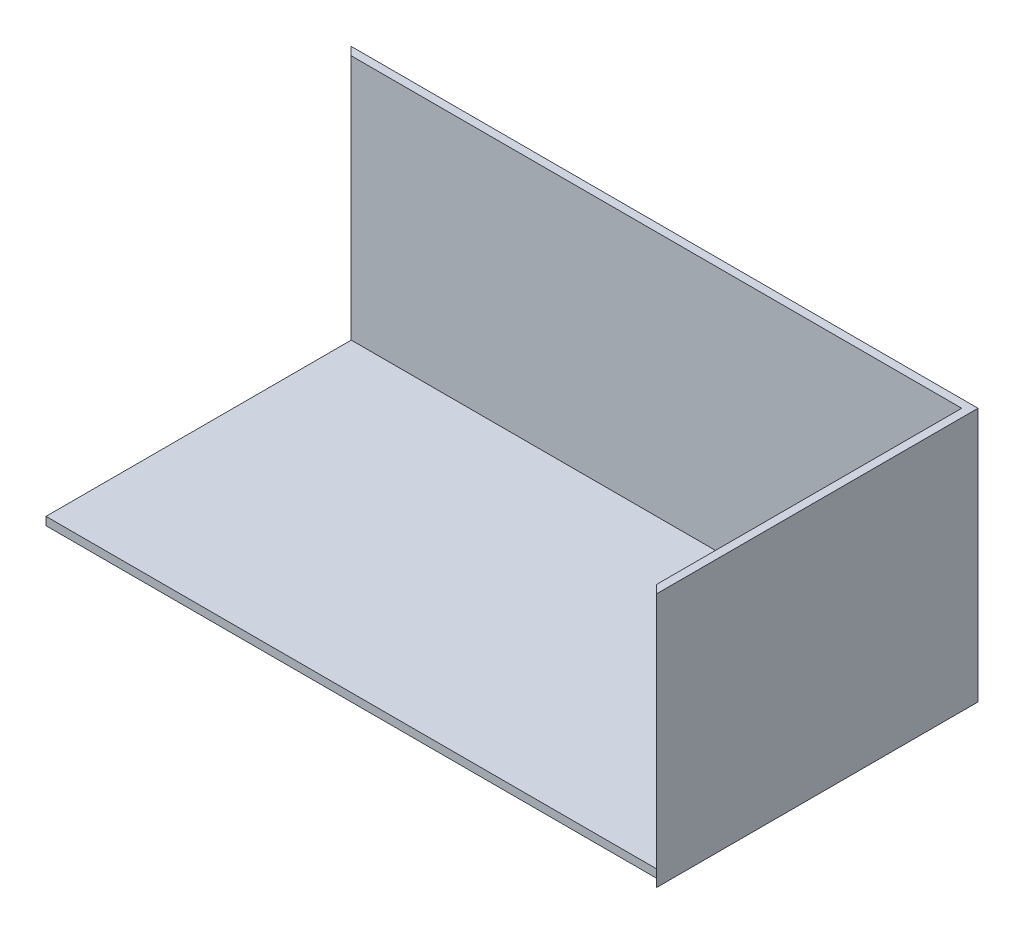
ISO-10303-21;
HEADER;
FILE_DESCRIPTION(('STEP AP214'),'2;1');
FILE_NAME('part.step','',(''),(''),'','','');
FILE_SCHEMA(('AUTOMOTIVE_DESIGN { 1 0 10303 214 1 1 1 1 }'));
ENDSEC;
DATA;
#1=APPLICATION_CONTEXT('core data for automotive mechanical design processes');
#2=APPLICATION_PROTOCOL_DEFINITION('international standard','automotive_design',2000,#1);
#3=PRODUCT_CONTEXT('',#1,'mechanical');
#4=PRODUCT('Part','Part','',(#3));
#5=PRODUCT_RELATED_PRODUCT_CATEGORY('part','',(#4));
#6=PRODUCT_DEFINITION_FORMATION('','',#4);
#7=PRODUCT_DEFINITION_CONTEXT('part definition',#1,'design');
#8=PRODUCT_DEFINITION('design','',#6,#7);
#9=PRODUCT_DEFINITION_SHAPE('','',#8);
#10=(LENGTH_UNIT() NAMED_UNIT(*) SI_UNIT(.MILLI.,.METRE.));
#11=(NAMED_UNIT(*) PLANE_ANGLE_UNIT() SI_UNIT($,.RADIAN.));
#12=(NAMED_UNIT(*) SI_UNIT($,.STERADIAN.) SOLID_ANGLE_UNIT());
#13=UNCERTAINTY_MEASURE_WITH_UNIT(LENGTH_MEASURE(1.E-05),#10,'distance_accuracy_value','');
#14=(GEOMETRIC_REPRESENTATION_CONTEXT(3) GLOBAL_UNCERTAINTY_ASSIGNED_CONTEXT((#13)) GLOBAL_UNIT_ASSIGNED_CONTEXT((#10,
#11,#12)) REPRESENTATION_CONTEXT('',''));
#15=CARTESIAN_POINT('',(0.,0.,0.));
#16=DIRECTION('',(0.,0.,1.));
#17=DIRECTION('',(1.,0.,0.));
#18=AXIS2_PLACEMENT_3D('',#15,#16,#17);
#19=CARTESIAN_POINT('',(0.,250.,-150.));
#20=DIRECTION('',(0.,0.,-1.));
#21=DIRECTION('',(-1.,0.,0.));
#22=AXIS2_PLACEMENT_3D('',#19,#20,#21);
#23=PLANE('',#22);
#24=DIRECTION('',(0.,-1.,0.));
#25=VECTOR('',#24,1.);
#26=CARTESIAN_POINT('',(-300.,250.,-150.));
#27=LINE('',#26,#25);
#28=CARTESIAN_POINT('',(-300.,250.,-150.));
#29=VERTEX_POINT('',#28);
#30=CARTESIAN_POINT('',(-300.,8.00000000000001,-150.));
#31=VERTEX_POINT('',#30);
#32=EDGE_CURVE('E172',#29,#31,#27,.T.);
#33=ORIENTED_EDGE('',*,*,#32,.T.);
#34=DIRECTION('',(1.,0.,0.));
#35=VECTOR('',#34,1.);
#36=CARTESIAN_POINT('',(0.,8.,-150.));
#37=LINE('',#36,#35);
#38=CARTESIAN_POINT('',(300.,8.00000000000001,-150.));
#39=VERTEX_POINT('',#38);
#40=EDGE_CURVE('E60',#31,#39,#37,.T.);
#41=ORIENTED_EDGE('',*,*,#40,.T.);
#42=DIRECTION('',(0.,-1.,0.));
#43=VECTOR('',#42,1.);
#44=CARTESIAN_POINT('',(300.,250.,-150.));
#45=LINE('',#44,#43);
#46=CARTESIAN_POINT('',(300.,250.,-150.));
#47=VERTEX_POINT('',#46);
#48=EDGE_CURVE('E11',#47,#39,#45,.T.);
#49=ORIENTED_EDGE('',*,*,#48,.F.);
#50=DIRECTION('',(1.,0.,0.));
#51=VECTOR('',#50,1.);
#52=CARTESIAN_POINT('',(0.,250.,-150.));
#53=LINE('',#52,#51);
#54=EDGE_CURVE('E149',#29,#47,#53,.T.);
#55=ORIENTED_EDGE('',*,*,#54,.F.);
#56=EDGE_LOOP('',(#33,#41,#49,#55));
#57=FACE_BOUND('',#56,.T.);
#58=ADVANCED_FACE('F45',(#57),#23,.F.);
#59=CARTESIAN_POINT('',(300.,250.,0.));
#60=DIRECTION('',(1.,0.,0.));
#61=DIRECTION('',(0.,0.,-1.));
#62=AXIS2_PLACEMENT_3D('',#59,#60,#61);
#63=PLANE('',#62);
#64=ORIENTED_EDGE('',*,*,#48,.T.);
#65=DIRECTION('',(0.,0.,1.));
#66=VECTOR('',#65,1.);
#67=CARTESIAN_POINT('',(300.,8.,0.));
#68=LINE('',#67,#66);
#69=CARTESIAN_POINT('',(300.,8.00000000000001,150.));
#70=VERTEX_POINT('',#69);
#71=EDGE_CURVE('E66',#39,#70,#68,.T.);
#72=ORIENTED_EDGE('',*,*,#71,.T.);
#73=DIRECTION('',(0.,-1.,0.));
#74=VECTOR('',#73,1.);
#75=CARTESIAN_POINT('',(300.,250.,150.));
#76=LINE('',#75,#74);
#77=CARTESIAN_POINT('',(300.,250.,150.));
#78=VERTEX_POINT('',#77);
#79=EDGE_CURVE('E53',#78,#70,#76,.T.);
#80=ORIENTED_EDGE('',*,*,#79,.F.);
#81=DIRECTION('',(0.,0.,1.));
#82=VECTOR('',#81,1.);
#83=CARTESIAN_POINT('',(300.,250.,0.));
#84=LINE('',#83,#82);
#85=EDGE_CURVE('E153',#47,#78,#84,.T.);
#86=ORIENTED_EDGE('',*,*,#85,.F.);
#87=EDGE_LOOP('',(#64,#72,#80,#86));
#88=FACE_BOUND('',#87,.T.);
#89=ADVANCED_FACE('F203',(#88),#63,.F.);
#90=CARTESIAN_POINT('',(74.9999999999995,250.,-74.9999999999998));
#91=DIRECTION('',(0.707106781186546,0.,-0.707106781186549));
#92=DIRECTION('',(-0.707106781186549,0.,-0.707106781186546));
#93=AXIS2_PLACEMENT_3D('',#90,#91,#92);
#94=PLANE('',#93);
#95=DIRECTION('',(0.707106781186549,0.,0.707106781186546));
#96=VECTOR('',#95,1.);
#97=CARTESIAN_POINT('',(74.9999999999995,0.,-74.9999999999998));
#98=LINE('',#97,#96);
#99=CARTESIAN_POINT('',(300.,0.,150.));
#100=VERTEX_POINT('',#99);
#101=CARTESIAN_POINT('',(308.,0.,158.));
#102=VERTEX_POINT('',#101);
#103=EDGE_CURVE('E148',#100,#102,#98,.T.);
#104=ORIENTED_EDGE('',*,*,#103,.T.);
#105=DIRECTION('',(0.,-1.,0.));
#106=VECTOR('',#105,1.);
#107=CARTESIAN_POINT('',(308.,250.,158.));
#108=LINE('',#107,#106);
#109=CARTESIAN_POINT('',(308.,250.,158.));
#110=VERTEX_POINT('',#109);
#111=EDGE_CURVE('E195',#110,#102,#108,.T.);
#112=ORIENTED_EDGE('',*,*,#111,.F.);
#113=DIRECTION('',(0.707106781186549,0.,0.707106781186546));
#114=VECTOR('',#113,1.);
#115=CARTESIAN_POINT('',(74.9999999999995,250.,-74.9999999999998));
#116=LINE('',#115,#114);
#117=EDGE_CURVE('E157',#78,#110,#116,.T.);
#118=ORIENTED_EDGE('',*,*,#117,.F.);
#119=ORIENTED_EDGE('',*,*,#79,.T.);
#120=DIRECTION('',(0.,-1.,0.));
#121=VECTOR('',#120,1.);
#122=CARTESIAN_POINT('',(300.,8.,150.));
#123=LINE('',#122,#121);
#124=EDGE_CURVE('E132',#70,#100,#123,.T.);
#125=ORIENTED_EDGE('',*,*,#124,.T.);
#126=EDGE_LOOP('',(#104,#112,#118,#119,#125));
#127=FACE_BOUND('',#126,.T.);
#128=ADVANCED_FACE('F200',(#127),#94,.F.);
#129=CARTESIAN_POINT('',(308.,250.,0.));
#130=DIRECTION('',(1.,0.,0.));
#131=DIRECTION('',(0.,0.,-1.));
#132=AXIS2_PLACEMENT_3D('',#129,#130,#131);
#133=PLANE('',#132);
#134=DIRECTION('',(0.,0.,1.));
#135=VECTOR('',#134,1.);
#136=CARTESIAN_POINT('',(308.,0.,0.));
#137=LINE('',#136,#135);
#138=CARTESIAN_POINT('',(308.,0.,-158.));
#139=VERTEX_POINT('',#138);
#140=EDGE_CURVE('E176',#139,#102,#137,.T.);
#141=ORIENTED_EDGE('',*,*,#140,.F.);
#142=DIRECTION('',(0.,-1.,0.));
#143=VECTOR('',#142,1.);
#144=CARTESIAN_POINT('',(308.,250.,-158.));
#145=LINE('',#144,#143);
#146=CARTESIAN_POINT('',(308.,250.,-158.));
#147=VERTEX_POINT('',#146);
#148=EDGE_CURVE('E192',#147,#139,#145,.T.);
#149=ORIENTED_EDGE('',*,*,#148,.F.);
#150=DIRECTION('',(0.,0.,1.));
#151=VECTOR('',#150,1.);
#152=CARTESIAN_POINT('',(308.,250.,0.));
#153=LINE('',#152,#151);
#154=EDGE_CURVE('E160',#147,#110,#153,.T.);
#155=ORIENTED_EDGE('',*,*,#154,.T.);
#156=ORIENTED_EDGE('',*,*,#111,.T.);
#157=EDGE_LOOP('',(#141,#149,#155,#156));
#158=FACE_BOUND('',#157,.T.);
#159=ADVANCED_FACE('F216',(#158),#133,.T.);
#160=CARTESIAN_POINT('',(0.,250.,-158.));
#161=DIRECTION('',(0.,0.,-1.));
#162=DIRECTION('',(-1.,0.,0.));
#163=AXIS2_PLACEMENT_3D('',#160,#161,#162);
#164=PLANE('',#163);
#165=DIRECTION('',(1.,0.,0.));
#166=VECTOR('',#165,1.);
#167=CARTESIAN_POINT('',(0.,0.,-158.));
#168=LINE('',#167,#166);
#169=CARTESIAN_POINT('',(-308.,0.,-158.));
#170=VERTEX_POINT('',#169);
#171=EDGE_CURVE('E180',#170,#139,#168,.T.);
#172=ORIENTED_EDGE('',*,*,#171,.F.);
#173=DIRECTION('',(0.,-1.,0.));
#174=VECTOR('',#173,1.);
#175=CARTESIAN_POINT('',(-308.,250.,-158.));
#176=LINE('',#175,#174);
#177=CARTESIAN_POINT('',(-308.,250.,-158.));
#178=VERTEX_POINT('',#177);
#179=EDGE_CURVE('E189',#178,#170,#176,.T.);
#180=ORIENTED_EDGE('',*,*,#179,.F.);
#181=DIRECTION('',(1.,0.,0.));
#182=VECTOR('',#181,1.);
#183=CARTESIAN_POINT('',(0.,250.,-158.));
#184=LINE('',#183,#182);
#185=EDGE_CURVE('E164',#178,#147,#184,.T.);
#186=ORIENTED_EDGE('',*,*,#185,.T.);
#187=ORIENTED_EDGE('',*,*,#148,.T.);
#188=EDGE_LOOP('',(#172,#180,#186,#187));
#189=FACE_BOUND('',#188,.T.);
#190=ADVANCED_FACE('F221',(#189),#164,.T.);
#191=CARTESIAN_POINT('',(-74.9999999999989,250.,74.9999999999995));
#192=DIRECTION('',(-0.707106781186545,0.,0.70710678118655));
#193=DIRECTION('',(0.70710678118655,0.,0.707106781186545));
#194=AXIS2_PLACEMENT_3D('',#191,#192,#193);
#195=PLANE('',#194);
#196=DIRECTION('',(-0.70710678118655,0.,-0.707106781186545));
#197=VECTOR('',#196,1.);
#198=CARTESIAN_POINT('',(-74.9999999999989,0.,74.9999999999995));
#199=LINE('',#198,#197);
#200=CARTESIAN_POINT('',(-300.,0.,-150.));
#201=VERTEX_POINT('',#200);
#202=EDGE_CURVE('E154',#201,#170,#199,.T.);
#203=ORIENTED_EDGE('',*,*,#202,.F.);
#204=DIRECTION('',(0.,-1.,0.));
#205=VECTOR('',#204,1.);
#206=CARTESIAN_POINT('',(-300.,8.,-150.));
#207=LINE('',#206,#205);
#208=EDGE_CURVE('E131',#31,#201,#207,.T.);
#209=ORIENTED_EDGE('',*,*,#208,.F.);
#210=ORIENTED_EDGE('',*,*,#32,.F.);
#211=DIRECTION('',(-0.70710678118655,0.,-0.707106781186545));
#212=VECTOR('',#211,1.);
#213=CARTESIAN_POINT('',(-74.9999999999989,250.,74.9999999999995));
#214=LINE('',#213,#212);
#215=EDGE_CURVE('E168',#29,#178,#214,.T.);
#216=ORIENTED_EDGE('',*,*,#215,.T.);
#217=ORIENTED_EDGE('',*,*,#179,.T.);
#218=EDGE_LOOP('',(#203,#209,#210,#216,#217));
#219=FACE_BOUND('',#218,.T.);
#220=ADVANCED_FACE('F225',(#219),#195,.T.);
#221=CARTESIAN_POINT('',(0.,250.,0.));
#222=DIRECTION('',(0.,1.,0.));
#223=DIRECTION('',(0.,0.,1.));
#224=AXIS2_PLACEMENT_3D('',#221,#222,#223);
#225=PLANE('',#224);
#226=ORIENTED_EDGE('',*,*,#54,.T.);
#227=ORIENTED_EDGE('',*,*,#85,.T.);
#228=ORIENTED_EDGE('',*,*,#117,.T.);
#229=ORIENTED_EDGE('',*,*,#154,.F.);
#230=ORIENTED_EDGE('',*,*,#185,.F.);
#231=ORIENTED_EDGE('',*,*,#215,.F.);
#232=EDGE_LOOP('',(#226,#227,#228,#229,#230,#231));
#233=FACE_BOUND('',#232,.T.);
#234=ADVANCED_FACE('F207',(#233),#225,.T.);
#235=CARTESIAN_POINT('',(0.,0.,0.));
#236=DIRECTION('',(0.,1.,0.));
#237=DIRECTION('',(0.,0.,1.));
#238=AXIS2_PLACEMENT_3D('',#235,#236,#237);
#239=PLANE('',#238);
#240=ORIENTED_EDGE('',*,*,#103,.F.);
#241=DIRECTION('',(1.,0.,0.));
#242=VECTOR('',#241,1.);
#243=CARTESIAN_POINT('',(0.,0.,150.));
#244=LINE('',#243,#242);
#245=CARTESIAN_POINT('',(-300.,0.,150.));
#246=VERTEX_POINT('',#245);
#247=EDGE_CURVE('E143',#246,#100,#244,.T.);
#248=ORIENTED_EDGE('',*,*,#247,.F.);
#249=DIRECTION('',(0.,0.,1.));
#250=VECTOR('',#249,1.);
#251=CARTESIAN_POINT('',(-300.,0.,0.));
#252=LINE('',#251,#250);
#253=EDGE_CURVE('E126',#201,#246,#252,.T.);
#254=ORIENTED_EDGE('',*,*,#253,.F.);
#255=ORIENTED_EDGE('',*,*,#202,.T.);
#256=ORIENTED_EDGE('',*,*,#171,.T.);
#257=ORIENTED_EDGE('',*,*,#140,.T.);
#258=EDGE_LOOP('',(#240,#248,#254,#255,#256,#257));
#259=FACE_BOUND('',#258,.T.);
#260=ADVANCED_FACE('F230',(#259),#239,.F.);
#261=CARTESIAN_POINT('',(-300.,8.,0.));
#262=DIRECTION('',(1.,0.,0.));
#263=DIRECTION('',(0.,0.,-1.));
#264=AXIS2_PLACEMENT_3D('',#261,#262,#263);
#265=PLANE('',#264);
#266=ORIENTED_EDGE('',*,*,#253,.T.);
#267=DIRECTION('',(0.,-1.,0.));
#268=VECTOR('',#267,1.);
#269=CARTESIAN_POINT('',(-300.,8.,150.));
#270=LINE('',#269,#268);
#271=CARTESIAN_POINT('',(-300.,8.,150.));
#272=VERTEX_POINT('',#271);
#273=EDGE_CURVE('E123',#272,#246,#270,.T.);
#274=ORIENTED_EDGE('',*,*,#273,.F.);
#275=DIRECTION('',(0.,0.,1.));
#276=VECTOR('',#275,1.);
#277=CARTESIAN_POINT('',(-300.,8.,0.));
#278=LINE('',#277,#276);
#279=EDGE_CURVE('E112',#31,#272,#278,.T.);
#280=ORIENTED_EDGE('',*,*,#279,.F.);
#281=ORIENTED_EDGE('',*,*,#208,.T.);
#282=EDGE_LOOP('',(#266,#274,#280,#281));
#283=FACE_BOUND('',#282,.T.);
#284=ADVANCED_FACE('F124',(#283),#265,.F.);
#285=CARTESIAN_POINT('',(0.,8.,150.));
#286=DIRECTION('',(0.,0.,-1.));
#287=DIRECTION('',(-1.,0.,0.));
#288=AXIS2_PLACEMENT_3D('',#285,#286,#287);
#289=PLANE('',#288);
#290=ORIENTED_EDGE('',*,*,#247,.T.);
#291=ORIENTED_EDGE('',*,*,#124,.F.);
#292=DIRECTION('',(1.,0.,0.));
#293=VECTOR('',#292,1.);
#294=CARTESIAN_POINT('',(0.,8.,150.));
#295=LINE('',#294,#293);
#296=EDGE_CURVE('E116',#272,#70,#295,.T.);
#297=ORIENTED_EDGE('',*,*,#296,.F.);
#298=ORIENTED_EDGE('',*,*,#273,.T.);
#299=EDGE_LOOP('',(#290,#291,#297,#298));
#300=FACE_BOUND('',#299,.T.);
#301=ADVANCED_FACE('F134',(#300),#289,.F.);
#302=CARTESIAN_POINT('',(0.,8.,0.));
#303=DIRECTION('',(0.,1.,0.));
#304=DIRECTION('',(0.,0.,1.));
#305=AXIS2_PLACEMENT_3D('',#302,#303,#304);
#306=PLANE('',#305);
#307=ORIENTED_EDGE('',*,*,#71,.F.);
#308=ORIENTED_EDGE('',*,*,#40,.F.);
#309=ORIENTED_EDGE('',*,*,#279,.T.);
#310=ORIENTED_EDGE('',*,*,#296,.T.);
#311=EDGE_LOOP('',(#307,#308,#309,#310));
#312=FACE_BOUND('',#311,.T.);
#313=ADVANCED_FACE('F114',(#312),#306,.T.);
#314=CLOSED_SHELL('',(#58,#89,#128,#159,#190,#220,#234,#260,#284,#301,#313));
#315=MANIFOLD_SOLID_BREP('B2',#314);
#316=ADVANCED_BREP_SHAPE_REPRESENTATION('',(#18,#315),#14);
#317=SHAPE_DEFINITION_REPRESENTATION(#9,#316);
ENDSEC;
END-ISO-10303-21;
